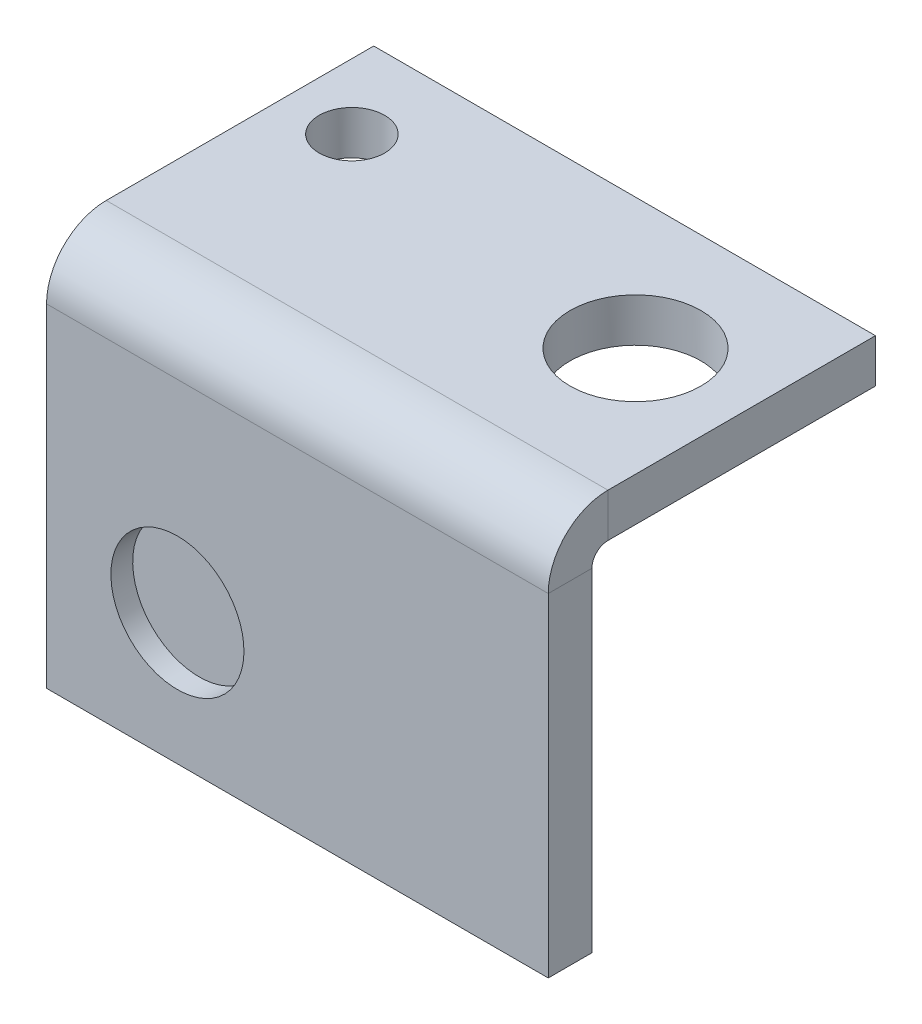
ISO-10303-21;
HEADER;
FILE_DESCRIPTION(('STEP AP214'),'2;1');
FILE_NAME('part.step','',(''),(''),'','','');
FILE_SCHEMA(('AUTOMOTIVE_DESIGN { 1 0 10303 214 1 1 1 1 }'));
ENDSEC;
DATA;
#1=APPLICATION_CONTEXT('core data for automotive mechanical design processes');
#2=APPLICATION_PROTOCOL_DEFINITION('international standard','automotive_design',2000,#1);
#3=PRODUCT_CONTEXT('',#1,'mechanical');
#4=PRODUCT('Part','Part','',(#3));
#5=PRODUCT_RELATED_PRODUCT_CATEGORY('part','',(#4));
#6=PRODUCT_DEFINITION_FORMATION('','',#4);
#7=PRODUCT_DEFINITION_CONTEXT('part definition',#1,'design');
#8=PRODUCT_DEFINITION('design','',#6,#7);
#9=PRODUCT_DEFINITION_SHAPE('','',#8);
#10=(LENGTH_UNIT() NAMED_UNIT(*) SI_UNIT(.MILLI.,.METRE.));
#11=(NAMED_UNIT(*) PLANE_ANGLE_UNIT() SI_UNIT($,.RADIAN.));
#12=(NAMED_UNIT(*) SI_UNIT($,.STERADIAN.) SOLID_ANGLE_UNIT());
#13=UNCERTAINTY_MEASURE_WITH_UNIT(LENGTH_MEASURE(1.E-05),#10,'distance_accuracy_value','');
#14=(GEOMETRIC_REPRESENTATION_CONTEXT(3) GLOBAL_UNCERTAINTY_ASSIGNED_CONTEXT((#13)) GLOBAL_UNIT_ASSIGNED_CONTEXT((#10,
#11,#12)) REPRESENTATION_CONTEXT('',''));
#15=CARTESIAN_POINT('',(0.,0.,0.));
#16=DIRECTION('',(0.,0.,1.));
#17=DIRECTION('',(1.,0.,0.));
#18=AXIS2_PLACEMENT_3D('',#15,#16,#17);
#19=CARTESIAN_POINT('',(25.,0.,0.));
#20=DIRECTION('',(1.,0.,0.));
#21=DIRECTION('',(0.,0.,1.));
#22=AXIS2_PLACEMENT_3D('',#19,#20,#21);
#23=PLANE('',#22);
#24=DIRECTION('',(0.,1.,0.));
#25=VECTOR('',#24,1.);
#26=CARTESIAN_POINT('',(25.,0.,0.));
#27=LINE('',#26,#25);
#28=CARTESIAN_POINT('',(25.,-18.,0.));
#29=VERTEX_POINT('',#28);
#30=CARTESIAN_POINT('',(25.,-2.73659999999998,0.));
#31=VERTEX_POINT('',#30);
#32=EDGE_CURVE('E137',#29,#31,#27,.T.);
#33=ORIENTED_EDGE('',*,*,#32,.F.);
#34=DIRECTION('',(0.,0.,1.));
#35=VECTOR('',#34,1.);
#36=CARTESIAN_POINT('',(25.,-18.,0.));
#37=LINE('',#36,#35);
#38=CARTESIAN_POINT('',(25.,-18.,-1.99999999999994));
#39=VERTEX_POINT('',#38);
#40=EDGE_CURVE('E199',#39,#29,#37,.T.);
#41=ORIENTED_EDGE('',*,*,#40,.F.);
#42=DIRECTION('',(0.,1.,0.));
#43=VECTOR('',#42,1.);
#44=CARTESIAN_POINT('',(25.,0.,-2.00000000000001));
#45=LINE('',#44,#43);
#46=CARTESIAN_POINT('',(25.,-2.7366,-2.));
#47=VERTEX_POINT('',#46);
#48=EDGE_CURVE('E128',#39,#47,#45,.T.);
#49=ORIENTED_EDGE('',*,*,#48,.T.);
#50=DIRECTION('',(0.,0.,-1.));
#51=VECTOR('',#50,1.);
#52=CARTESIAN_POINT('',(25.,-2.73659999999998,0.));
#53=LINE('',#52,#51);
#54=EDGE_CURVE('E11',#31,#47,#53,.T.);
#55=ORIENTED_EDGE('',*,*,#54,.F.);
#56=EDGE_LOOP('',(#33,#41,#49,#55));
#57=FACE_BOUND('',#56,.T.);
#58=ADVANCED_FACE('F39',(#57),#23,.T.);
#59=DIRECTION('',(0.,0.,1.));
#60=VECTOR('',#59,1.);
#61=CARTESIAN_POINT('',(25.,-2.,-15.));
#62=LINE('',#61,#60);
#63=CARTESIAN_POINT('',(25.,-2.,-15.));
#64=VERTEX_POINT('',#63);
#65=CARTESIAN_POINT('',(25.,-2.,-2.7366));
#66=VERTEX_POINT('',#65);
#67=EDGE_CURVE('E132',#64,#66,#62,.T.);
#68=ORIENTED_EDGE('',*,*,#67,.F.);
#69=DIRECTION('',(0.,-1.,0.));
#70=VECTOR('',#69,1.);
#71=CARTESIAN_POINT('',(25.,0.,-15.));
#72=LINE('',#71,#70);
#73=CARTESIAN_POINT('',(25.,0.,-15.));
#74=VERTEX_POINT('',#73);
#75=EDGE_CURVE('E111',#74,#64,#72,.T.);
#76=ORIENTED_EDGE('',*,*,#75,.F.);
#77=DIRECTION('',(0.,0.,-1.));
#78=VECTOR('',#77,1.);
#79=CARTESIAN_POINT('',(25.,0.,-15.));
#80=LINE('',#79,#78);
#81=CARTESIAN_POINT('',(25.,0.,-2.7366));
#82=VERTEX_POINT('',#81);
#83=EDGE_CURVE('E121',#82,#74,#80,.T.);
#84=ORIENTED_EDGE('',*,*,#83,.F.);
#85=DIRECTION('',(0.,1.,0.));
#86=VECTOR('',#85,1.);
#87=CARTESIAN_POINT('',(25.,-2.,-2.7366));
#88=LINE('',#87,#86);
#89=EDGE_CURVE('E47',#66,#82,#88,.T.);
#90=ORIENTED_EDGE('',*,*,#89,.F.);
#91=EDGE_LOOP('',(#68,#76,#84,#90));
#92=FACE_BOUND('',#91,.T.);
#93=ADVANCED_FACE('F130',(#92),#23,.T.);
#94=CARTESIAN_POINT('',(0.,-2.,-15.));
#95=DIRECTION('',(0.,1.,0.));
#96=DIRECTION('',(0.,0.,-1.));
#97=AXIS2_PLACEMENT_3D('',#94,#95,#96);
#98=PLANE('',#97);
#99=CARTESIAN_POINT('',(5.,-2.,-11.));
#100=DIRECTION('',(0.,1.,0.));
#101=DIRECTION('',(0.,0.,1.));
#102=AXIS2_PLACEMENT_3D('',#99,#100,#101);
#103=CIRCLE('',#102,1.5);
#104=CARTESIAN_POINT('',(5.,-2.,-9.5));
#105=VERTEX_POINT('',#104);
#106=EDGE_CURVE('E183',#105,#105,#103,.T.);
#107=ORIENTED_EDGE('',*,*,#106,.T.);
#108=EDGE_LOOP('',(#107));
#109=FACE_BOUND('',#108,.T.);
#110=CARTESIAN_POINT('',(20.,-2.,-9.));
#111=DIRECTION('',(0.,1.,0.));
#112=DIRECTION('',(0.,0.,1.));
#113=AXIS2_PLACEMENT_3D('',#110,#111,#112);
#114=CIRCLE('',#113,3.);
#115=CARTESIAN_POINT('',(20.,-2.,-6.));
#116=VERTEX_POINT('',#115);
#117=EDGE_CURVE('E167',#116,#116,#114,.T.);
#118=ORIENTED_EDGE('',*,*,#117,.T.);
#119=EDGE_LOOP('',(#118));
#120=FACE_BOUND('',#119,.T.);
#121=ORIENTED_EDGE('',*,*,#67,.T.);
#122=DIRECTION('',(1.,0.,0.));
#123=VECTOR('',#122,1.);
#124=CARTESIAN_POINT('',(30.,-2.,-2.7366));
#125=LINE('',#124,#123);
#126=CARTESIAN_POINT('',(2.,-2.,-2.7366));
#127=VERTEX_POINT('',#126);
#128=EDGE_CURVE('E175',#66,#127,#125,.F.);
#129=ORIENTED_EDGE('',*,*,#128,.T.);
#130=DIRECTION('',(0.,0.,1.));
#131=VECTOR('',#130,1.);
#132=CARTESIAN_POINT('',(2.,-2.,-15.));
#133=LINE('',#132,#131);
#134=CARTESIAN_POINT('',(2.,-2.,-15.));
#135=VERTEX_POINT('',#134);
#136=EDGE_CURVE('E159',#135,#127,#133,.T.);
#137=ORIENTED_EDGE('',*,*,#136,.F.);
#138=DIRECTION('',(1.,0.,0.));
#139=VECTOR('',#138,1.);
#140=CARTESIAN_POINT('',(0.,-2.,-15.));
#141=LINE('',#140,#139);
#142=EDGE_CURVE('E117',#135,#64,#141,.T.);
#143=ORIENTED_EDGE('',*,*,#142,.T.);
#144=EDGE_LOOP('',(#121,#129,#137,#143));
#145=FACE_BOUND('',#144,.T.);
#146=ADVANCED_FACE('F41',(#109,#120,#145),#98,.F.);
#147=CARTESIAN_POINT('',(0.,0.,-15.));
#148=DIRECTION('',(0.,1.,0.));
#149=DIRECTION('',(0.,0.,-1.));
#150=AXIS2_PLACEMENT_3D('',#147,#148,#149);
#151=PLANE('',#150);
#152=CARTESIAN_POINT('',(20.,0.,-9.));
#153=DIRECTION('',(0.,-1.,0.));
#154=DIRECTION('',(0.,0.,-1.));
#155=AXIS2_PLACEMENT_3D('',#152,#153,#154);
#156=CIRCLE('',#155,3.);
#157=CARTESIAN_POINT('',(20.,0.,-12.));
#158=VERTEX_POINT('',#157);
#159=EDGE_CURVE('E172',#158,#158,#156,.T.);
#160=ORIENTED_EDGE('',*,*,#159,.T.);
#161=EDGE_LOOP('',(#160));
#162=FACE_BOUND('',#161,.T.);
#163=CARTESIAN_POINT('',(5.,0.,-11.));
#164=DIRECTION('',(0.,-1.,0.));
#165=DIRECTION('',(0.,0.,-1.));
#166=AXIS2_PLACEMENT_3D('',#163,#164,#165);
#167=CIRCLE('',#166,1.5);
#168=CARTESIAN_POINT('',(5.,0.,-12.5));
#169=VERTEX_POINT('',#168);
#170=EDGE_CURVE('E188',#169,#169,#167,.T.);
#171=ORIENTED_EDGE('',*,*,#170,.T.);
#172=EDGE_LOOP('',(#171));
#173=FACE_BOUND('',#172,.T.);
#174=DIRECTION('',(1.,0.,0.));
#175=VECTOR('',#174,1.);
#176=CARTESIAN_POINT('',(0.,0.,-15.));
#177=LINE('',#176,#175);
#178=CARTESIAN_POINT('',(2.,0.,-15.));
#179=VERTEX_POINT('',#178);
#180=EDGE_CURVE('E106',#179,#74,#177,.T.);
#181=ORIENTED_EDGE('',*,*,#180,.F.);
#182=DIRECTION('',(0.,0.,1.));
#183=VECTOR('',#182,1.);
#184=CARTESIAN_POINT('',(2.,0.,-15.));
#185=LINE('',#184,#183);
#186=CARTESIAN_POINT('',(2.,0.,-2.7366));
#187=VERTEX_POINT('',#186);
#188=EDGE_CURVE('E157',#179,#187,#185,.T.);
#189=ORIENTED_EDGE('',*,*,#188,.T.);
#190=DIRECTION('',(1.,0.,0.));
#191=VECTOR('',#190,1.);
#192=CARTESIAN_POINT('',(30.,0.,-2.7366));
#193=LINE('',#192,#191);
#194=EDGE_CURVE('E124',#82,#187,#193,.F.);
#195=ORIENTED_EDGE('',*,*,#194,.F.);
#196=ORIENTED_EDGE('',*,*,#83,.T.);
#197=EDGE_LOOP('',(#181,#189,#195,#196));
#198=FACE_BOUND('',#197,.T.);
#199=ADVANCED_FACE('F122',(#162,#173,#198),#151,.T.);
#200=CARTESIAN_POINT('',(0.,0.,-15.));
#201=DIRECTION('',(0.,0.,1.));
#202=DIRECTION('',(-1.,0.,0.));
#203=AXIS2_PLACEMENT_3D('',#200,#201,#202);
#204=PLANE('',#203);
#205=ORIENTED_EDGE('',*,*,#75,.T.);
#206=ORIENTED_EDGE('',*,*,#142,.F.);
#207=DIRECTION('',(0.,-1.,0.));
#208=VECTOR('',#207,1.);
#209=CARTESIAN_POINT('',(2.,0.,-15.));
#210=LINE('',#209,#208);
#211=EDGE_CURVE('E113',#179,#135,#210,.T.);
#212=ORIENTED_EDGE('',*,*,#211,.F.);
#213=ORIENTED_EDGE('',*,*,#180,.T.);
#214=EDGE_LOOP('',(#205,#206,#212,#213));
#215=FACE_BOUND('',#214,.T.);
#216=ADVANCED_FACE('F108',(#215),#204,.F.);
#217=CARTESIAN_POINT('',(30.,-2.7366,-2.7366));
#218=DIRECTION('',(1.,0.,0.));
#219=DIRECTION('',(0.,0.,1.));
#220=AXIS2_PLACEMENT_3D('',#217,#218,#219);
#221=CYLINDRICAL_SURFACE('',#220,2.7366);
#222=ORIENTED_EDGE('',*,*,#194,.T.);
#223=CARTESIAN_POINT('',(2.,-2.7366,-2.7366));
#224=DIRECTION('',(-1.,0.,0.));
#225=DIRECTION('',(0.,0.,1.));
#226=AXIS2_PLACEMENT_3D('',#223,#224,#225);
#227=CIRCLE('',#226,2.7366);
#228=CARTESIAN_POINT('',(2.,-2.73659999999998,0.));
#229=VERTEX_POINT('',#228);
#230=EDGE_CURVE('E154',#187,#229,#227,.F.);
#231=ORIENTED_EDGE('',*,*,#230,.T.);
#232=DIRECTION('',(1.,0.,0.));
#233=VECTOR('',#232,1.);
#234=CARTESIAN_POINT('',(0.,-2.73659999999998,0.));
#235=LINE('',#234,#233);
#236=EDGE_CURVE('E177',#31,#229,#235,.F.);
#237=ORIENTED_EDGE('',*,*,#236,.F.);
#238=CARTESIAN_POINT('',(25.,-2.7366,-2.7366));
#239=DIRECTION('',(-1.,0.,0.));
#240=DIRECTION('',(0.,0.,1.));
#241=AXIS2_PLACEMENT_3D('',#238,#239,#240);
#242=CIRCLE('',#241,2.7366);
#243=EDGE_CURVE('E143',#82,#31,#242,.F.);
#244=ORIENTED_EDGE('',*,*,#243,.F.);
#245=EDGE_LOOP('',(#222,#231,#237,#244));
#246=FACE_BOUND('',#245,.T.);
#247=ADVANCED_FACE('F213',(#246),#221,.T.);
#248=CARTESIAN_POINT('',(30.,-2.7366,-2.7366));
#249=DIRECTION('',(1.,0.,0.));
#250=DIRECTION('',(0.,0.,1.));
#251=AXIS2_PLACEMENT_3D('',#248,#249,#250);
#252=CYLINDRICAL_SURFACE('',#251,0.7366);
#253=CARTESIAN_POINT('',(25.,-2.7366,-2.7366));
#254=DIRECTION('',(-1.,0.,0.));
#255=DIRECTION('',(0.,0.,1.));
#256=AXIS2_PLACEMENT_3D('',#253,#254,#255);
#257=CIRCLE('',#256,0.7366);
#258=EDGE_CURVE('E140',#66,#47,#257,.F.);
#259=ORIENTED_EDGE('',*,*,#258,.T.);
#260=DIRECTION('',(1.,0.,0.));
#261=VECTOR('',#260,1.);
#262=CARTESIAN_POINT('',(0.,-2.7366,-2.));
#263=LINE('',#262,#261);
#264=CARTESIAN_POINT('',(2.,-2.7366,-2.));
#265=VERTEX_POINT('',#264);
#266=EDGE_CURVE('E180',#265,#47,#263,.T.);
#267=ORIENTED_EDGE('',*,*,#266,.F.);
#268=CARTESIAN_POINT('',(2.,-2.7366,-2.7366));
#269=DIRECTION('',(-1.,0.,0.));
#270=DIRECTION('',(0.,0.,1.));
#271=AXIS2_PLACEMENT_3D('',#268,#269,#270);
#272=CIRCLE('',#271,0.7366);
#273=EDGE_CURVE('E151',#127,#265,#272,.F.);
#274=ORIENTED_EDGE('',*,*,#273,.F.);
#275=ORIENTED_EDGE('',*,*,#128,.F.);
#276=EDGE_LOOP('',(#259,#267,#274,#275));
#277=FACE_BOUND('',#276,.T.);
#278=ADVANCED_FACE('F267',(#277),#252,.F.);
#279=CARTESIAN_POINT('',(0.,0.,0.));
#280=DIRECTION('',(0.,0.,-1.));
#281=DIRECTION('',(0.,-1.,0.));
#282=AXIS2_PLACEMENT_3D('',#279,#280,#281);
#283=PLANE('',#282);
#284=CARTESIAN_POINT('',(8.,-12.,0.));
#285=DIRECTION('',(0.,0.,-1.));
#286=DIRECTION('',(0.,1.,0.));
#287=AXIS2_PLACEMENT_3D('',#284,#285,#286);
#288=CIRCLE('',#287,3.05);
#289=CARTESIAN_POINT('',(8.,-8.95,0.));
#290=VERTEX_POINT('',#289);
#291=EDGE_CURVE('E163',#290,#290,#288,.T.);
#292=ORIENTED_EDGE('',*,*,#291,.T.);
#293=EDGE_LOOP('',(#292));
#294=FACE_BOUND('',#293,.T.);
#295=ORIENTED_EDGE('',*,*,#32,.T.);
#296=ORIENTED_EDGE('',*,*,#236,.T.);
#297=DIRECTION('',(0.,1.,0.));
#298=VECTOR('',#297,1.);
#299=CARTESIAN_POINT('',(2.,0.,0.));
#300=LINE('',#299,#298);
#301=CARTESIAN_POINT('',(2.,-18.,0.));
#302=VERTEX_POINT('',#301);
#303=EDGE_CURVE('E149',#302,#229,#300,.T.);
#304=ORIENTED_EDGE('',*,*,#303,.F.);
#305=DIRECTION('',(-1.,0.,0.));
#306=VECTOR('',#305,1.);
#307=CARTESIAN_POINT('',(0.,-18.,0.));
#308=LINE('',#307,#306);
#309=EDGE_CURVE('E173',#29,#302,#308,.T.);
#310=ORIENTED_EDGE('',*,*,#309,.F.);
#311=EDGE_LOOP('',(#295,#296,#304,#310));
#312=FACE_BOUND('',#311,.T.);
#313=ADVANCED_FACE('F220',(#294,#312),#283,.F.);
#314=CARTESIAN_POINT('',(0.,0.,-2.00000000000001));
#315=DIRECTION('',(0.,0.,-1.));
#316=DIRECTION('',(0.,-1.,0.));
#317=AXIS2_PLACEMENT_3D('',#314,#315,#316);
#318=PLANE('',#317);
#319=DIRECTION('',(1.,0.,0.));
#320=VECTOR('',#319,1.);
#321=CARTESIAN_POINT('',(0.,-18.,-1.99999999999994));
#322=LINE('',#321,#320);
#323=CARTESIAN_POINT('',(2.,-18.,-1.99999999999994));
#324=VERTEX_POINT('',#323);
#325=EDGE_CURVE('E54',#39,#324,#322,.F.);
#326=ORIENTED_EDGE('',*,*,#325,.T.);
#327=DIRECTION('',(0.,1.,0.));
#328=VECTOR('',#327,1.);
#329=CARTESIAN_POINT('',(2.,0.,-2.00000000000001));
#330=LINE('',#329,#328);
#331=EDGE_CURVE('E146',#324,#265,#330,.T.);
#332=ORIENTED_EDGE('',*,*,#331,.T.);
#333=ORIENTED_EDGE('',*,*,#266,.T.);
#334=ORIENTED_EDGE('',*,*,#48,.F.);
#335=EDGE_LOOP('',(#326,#332,#333,#334));
#336=FACE_BOUND('',#335,.T.);
#337=ADVANCED_FACE('F224',(#336),#318,.T.);
#338=CARTESIAN_POINT('',(0.,-18.,0.));
#339=DIRECTION('',(0.,1.,0.));
#340=DIRECTION('',(0.,0.,-1.));
#341=AXIS2_PLACEMENT_3D('',#338,#339,#340);
#342=PLANE('',#341);
#343=ORIENTED_EDGE('',*,*,#40,.T.);
#344=ORIENTED_EDGE('',*,*,#309,.T.);
#345=DIRECTION('',(0.,0.,1.));
#346=VECTOR('',#345,1.);
#347=CARTESIAN_POINT('',(2.,-18.,0.));
#348=LINE('',#347,#346);
#349=EDGE_CURVE('E61',#324,#302,#348,.T.);
#350=ORIENTED_EDGE('',*,*,#349,.F.);
#351=ORIENTED_EDGE('',*,*,#325,.F.);
#352=EDGE_LOOP('',(#343,#344,#350,#351));
#353=FACE_BOUND('',#352,.T.);
#354=ADVANCED_FACE('F221',(#353),#342,.F.);
#355=CARTESIAN_POINT('',(2.,0.,0.));
#356=DIRECTION('',(1.,0.,0.));
#357=DIRECTION('',(0.,0.,1.));
#358=AXIS2_PLACEMENT_3D('',#355,#356,#357);
#359=PLANE('',#358);
#360=ORIENTED_EDGE('',*,*,#331,.F.);
#361=ORIENTED_EDGE('',*,*,#349,.T.);
#362=ORIENTED_EDGE('',*,*,#303,.T.);
#363=DIRECTION('',(0.,0.,1.));
#364=VECTOR('',#363,1.);
#365=CARTESIAN_POINT('',(2.,-2.7366,-2.));
#366=LINE('',#365,#364);
#367=EDGE_CURVE('E197',#265,#229,#366,.T.);
#368=ORIENTED_EDGE('',*,*,#367,.F.);
#369=EDGE_LOOP('',(#360,#361,#362,#368));
#370=FACE_BOUND('',#369,.T.);
#371=ADVANCED_FACE('F223',(#370),#359,.F.);
#372=ORIENTED_EDGE('',*,*,#188,.F.);
#373=ORIENTED_EDGE('',*,*,#211,.T.);
#374=ORIENTED_EDGE('',*,*,#136,.T.);
#375=DIRECTION('',(0.,-1.,0.));
#376=VECTOR('',#375,1.);
#377=CARTESIAN_POINT('',(2.,0.,-2.7366));
#378=LINE('',#377,#376);
#379=EDGE_CURVE('E195',#187,#127,#378,.T.);
#380=ORIENTED_EDGE('',*,*,#379,.F.);
#381=EDGE_LOOP('',(#372,#373,#374,#380));
#382=FACE_BOUND('',#381,.T.);
#383=ADVANCED_FACE('F207',(#382),#359,.F.);
#384=CARTESIAN_POINT('',(5.,8.,-11.));
#385=DIRECTION('',(0.,-1.,0.));
#386=DIRECTION('',(0.,0.,1.));
#387=AXIS2_PLACEMENT_3D('',#384,#385,#386);
#388=CYLINDRICAL_SURFACE('',#387,1.5);
#389=ORIENTED_EDGE('',*,*,#170,.F.);
#390=EDGE_LOOP('',(#389));
#391=FACE_BOUND('',#390,.T.);
#392=ORIENTED_EDGE('',*,*,#106,.F.);
#393=EDGE_LOOP('',(#392));
#394=FACE_BOUND('',#393,.T.);
#395=ADVANCED_FACE('F251',(#391,#394),#388,.F.);
#396=CARTESIAN_POINT('',(20.,8.,-9.));
#397=DIRECTION('',(0.,-1.,0.));
#398=DIRECTION('',(0.,0.,1.));
#399=AXIS2_PLACEMENT_3D('',#396,#397,#398);
#400=CYLINDRICAL_SURFACE('',#399,3.);
#401=ORIENTED_EDGE('',*,*,#159,.F.);
#402=EDGE_LOOP('',(#401));
#403=FACE_BOUND('',#402,.T.);
#404=ORIENTED_EDGE('',*,*,#117,.F.);
#405=EDGE_LOOP('',(#404));
#406=FACE_BOUND('',#405,.T.);
#407=ADVANCED_FACE('F255',(#403,#406),#400,.F.);
#408=CARTESIAN_POINT('',(8.,-12.,-0.999999999999958));
#409=DIRECTION('',(0.,0.,1.));
#410=DIRECTION('',(0.,1.,0.));
#411=AXIS2_PLACEMENT_3D('',#408,#409,#410);
#412=CYLINDRICAL_SURFACE('',#411,3.05);
#413=CARTESIAN_POINT('',(8.,-12.,-0.999999999999958));
#414=DIRECTION('',(0.,0.,-1.));
#415=DIRECTION('',(0.,1.,0.));
#416=AXIS2_PLACEMENT_3D('',#413,#414,#415);
#417=CIRCLE('',#416,3.05);
#418=CARTESIAN_POINT('',(8.,-8.95000000000001,-0.999999999999969));
#419=VERTEX_POINT('',#418);
#420=EDGE_CURVE('E164',#419,#419,#417,.T.);
#421=ORIENTED_EDGE('',*,*,#420,.T.);
#422=EDGE_LOOP('',(#421));
#423=FACE_BOUND('',#422,.T.);
#424=ORIENTED_EDGE('',*,*,#291,.F.);
#425=EDGE_LOOP('',(#424));
#426=FACE_BOUND('',#425,.T.);
#427=ADVANCED_FACE('F247',(#423,#426),#412,.F.);
#428=CARTESIAN_POINT('',(8.,-12.,-0.999999999999958));
#429=DIRECTION('',(0.,0.,1.));
#430=DIRECTION('',(0.,1.,0.));
#431=AXIS2_PLACEMENT_3D('',#428,#429,#430);
#432=PLANE('',#431);
#433=ORIENTED_EDGE('',*,*,#420,.F.);
#434=EDGE_LOOP('',(#433));
#435=FACE_BOUND('',#434,.T.);
#436=ADVANCED_FACE('F243',(#435),#432,.T.);
#437=ORIENTED_EDGE('',*,*,#367,.T.);
#438=ORIENTED_EDGE('',*,*,#230,.F.);
#439=ORIENTED_EDGE('',*,*,#379,.T.);
#440=ORIENTED_EDGE('',*,*,#273,.T.);
#441=EDGE_LOOP('',(#437,#438,#439,#440));
#442=FACE_BOUND('',#441,.T.);
#443=ADVANCED_FACE('F211',(#442),#359,.F.);
#444=ORIENTED_EDGE('',*,*,#54,.T.);
#445=ORIENTED_EDGE('',*,*,#258,.F.);
#446=ORIENTED_EDGE('',*,*,#89,.T.);
#447=ORIENTED_EDGE('',*,*,#243,.T.);
#448=EDGE_LOOP('',(#444,#445,#446,#447));
#449=FACE_BOUND('',#448,.T.);
#450=ADVANCED_FACE('F201',(#449),#23,.T.);
#451=CLOSED_SHELL('',(#58,#93,#146,#199,#216,#247,#278,#313,#337,#354,#371,#383,#395,#407,#427,
#436,#443,#450));
#452=MANIFOLD_SOLID_BREP('B2',#451);
#453=ADVANCED_BREP_SHAPE_REPRESENTATION('',(#18,#452),#14);
#454=SHAPE_DEFINITION_REPRESENTATION(#9,#453);
ENDSEC;
END-ISO-10303-21;
